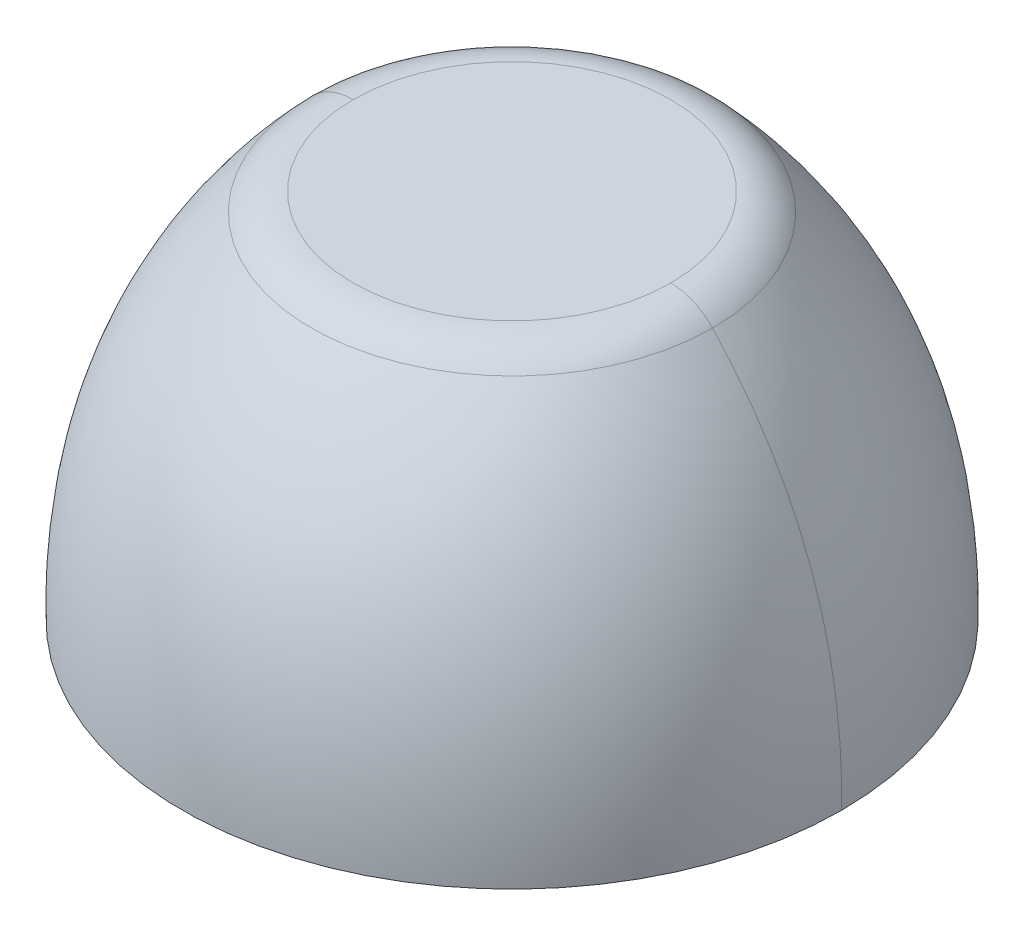
ISO-10303-21;
HEADER;
FILE_DESCRIPTION(('STEP AP214'),'2;1');
FILE_NAME('part.step','',(''),(''),'','','');
FILE_SCHEMA(('AUTOMOTIVE_DESIGN { 1 0 10303 214 1 1 1 1 }'));
ENDSEC;
DATA;
#1=APPLICATION_CONTEXT('core data for automotive mechanical design processes');
#2=APPLICATION_PROTOCOL_DEFINITION('international standard','automotive_design',2000,#1);
#3=PRODUCT_CONTEXT('',#1,'mechanical');
#4=PRODUCT('Part','Part','',(#3));
#5=PRODUCT_RELATED_PRODUCT_CATEGORY('part','',(#4));
#6=PRODUCT_DEFINITION_FORMATION('','',#4);
#7=PRODUCT_DEFINITION_CONTEXT('part definition',#1,'design');
#8=PRODUCT_DEFINITION('design','',#6,#7);
#9=PRODUCT_DEFINITION_SHAPE('','',#8);
#10=(LENGTH_UNIT() NAMED_UNIT(*) SI_UNIT(.MILLI.,.METRE.));
#11=(NAMED_UNIT(*) PLANE_ANGLE_UNIT() SI_UNIT($,.RADIAN.));
#12=(NAMED_UNIT(*) SI_UNIT($,.STERADIAN.) SOLID_ANGLE_UNIT());
#13=UNCERTAINTY_MEASURE_WITH_UNIT(LENGTH_MEASURE(1.E-05),#10,'distance_accuracy_value','');
#14=(GEOMETRIC_REPRESENTATION_CONTEXT(3) GLOBAL_UNCERTAINTY_ASSIGNED_CONTEXT((#13)) GLOBAL_UNIT_ASSIGNED_CONTEXT((#10,
#11,#12)) REPRESENTATION_CONTEXT('',''));
#15=CARTESIAN_POINT('',(0.,0.,0.));
#16=DIRECTION('',(0.,0.,1.));
#17=DIRECTION('',(1.,0.,0.));
#18=AXIS2_PLACEMENT_3D('',#15,#16,#17);
#19=CARTESIAN_POINT('',(0.,0.55,0.));
#20=DIRECTION('',(0.,-1.,0.));
#21=DIRECTION('',(1.,0.,0.));
#22=AXIS2_PLACEMENT_3D('',#19,#20,#21);
#23=TOROIDAL_SURFACE('',#22,0.277974451190381,0.1);
#24=CARTESIAN_POINT('',(-0.277974451190381,0.55,0.));
#25=DIRECTION('',(0.,0.,1.));
#26=DIRECTION('',(1.,0.,0.));
#27=AXIS2_PLACEMENT_3D('',#24,#25,#26);
#28=CIRCLE('',#27,0.1);
#29=CARTESIAN_POINT('',(-0.277974451190381,0.65,0.));
#30=VERTEX_POINT('',#29);
#31=CARTESIAN_POINT('',(-0.351124131169325,0.618184487377835,0.));
#32=VERTEX_POINT('',#31);
#33=EDGE_CURVE('E72',#30,#32,#28,.T.);
#34=ORIENTED_EDGE('',*,*,#33,.F.);
#35=CARTESIAN_POINT('',(0.,0.65,0.));
#36=DIRECTION('',(0.,1.,0.));
#37=DIRECTION('',(1.,0.,0.));
#38=AXIS2_PLACEMENT_3D('',#35,#36,#37);
#39=CIRCLE('',#38,0.277974451190381);
#40=CARTESIAN_POINT('',(0.277974451190381,0.65,0.));
#41=VERTEX_POINT('',#40);
#42=EDGE_CURVE('E11',#41,#30,#39,.T.);
#43=ORIENTED_EDGE('',*,*,#42,.F.);
#44=CARTESIAN_POINT('',(0.277974451190381,0.55,0.));
#45=DIRECTION('',(0.,0.,-1.));
#46=DIRECTION('',(-1.,0.,0.));
#47=AXIS2_PLACEMENT_3D('',#44,#45,#46);
#48=CIRCLE('',#47,0.1);
#49=CARTESIAN_POINT('',(0.351124131169325,0.618184487377835,0.));
#50=VERTEX_POINT('',#49);
#51=EDGE_CURVE('E50',#41,#50,#48,.T.);
#52=ORIENTED_EDGE('',*,*,#51,.T.);
#53=CARTESIAN_POINT('',(0.,0.618184487377835,0.));
#54=DIRECTION('',(0.,-1.,0.));
#55=DIRECTION('',(1.,0.,0.));
#56=AXIS2_PLACEMENT_3D('',#53,#54,#55);
#57=CIRCLE('',#56,0.351124131169325);
#58=EDGE_CURVE('E81',#32,#50,#57,.T.);
#59=ORIENTED_EDGE('',*,*,#58,.F.);
#60=EDGE_LOOP('',(#34,#43,#52,#59));
#61=FACE_BOUND('',#60,.T.);
#62=ADVANCED_FACE('F16',(#61),#23,.T.);
#63=CARTESIAN_POINT('',(0.,0.65,0.));
#64=DIRECTION('',(0.,-1.,0.));
#65=DIRECTION('',(0.,0.,-1.));
#66=AXIS2_PLACEMENT_3D('',#63,#64,#65);
#67=PLANE('',#66);
#68=ORIENTED_EDGE('',*,*,#42,.T.);
#69=CARTESIAN_POINT('',(0.,0.65,0.));
#70=DIRECTION('',(0.,1.,0.));
#71=DIRECTION('',(1.,0.,0.));
#72=AXIS2_PLACEMENT_3D('',#69,#70,#71);
#73=CIRCLE('',#72,0.277974451190381);
#74=EDGE_CURVE('E76',#30,#41,#73,.T.);
#75=ORIENTED_EDGE('',*,*,#74,.T.);
#76=EDGE_LOOP('',(#68,#75));
#77=FACE_BOUND('',#76,.T.);
#78=ADVANCED_FACE('F109',(#77),#67,.F.);
#79=CARTESIAN_POINT('',(0.351124131169233,0.618184487377934,0.));
#80=CARTESIAN_POINT('',(0.351124131169233,0.618184487377933,0.702248262338466));
#81=CARTESIAN_POINT('',(-0.351124131169233,0.618184487377933,0.702248262338466));
#82=CARTESIAN_POINT('',(-0.351124131169233,0.618184487377934,0.));
#83=CARTESIAN_POINT('',(0.583854239584369,0.368506978499879,0.));
#84=CARTESIAN_POINT('',(0.583854239584369,0.36850697849988,1.16770847916874));
#85=CARTESIAN_POINT('',(-0.583854239584368,0.36850697849988,1.16770847916874));
#86=CARTESIAN_POINT('',(-0.583854239584369,0.368506978499879,0.));
#87=CARTESIAN_POINT('',(0.576727971236533,0.,0.));
#88=CARTESIAN_POINT('',(0.576727971236533,0.,1.15345594247306));
#89=CARTESIAN_POINT('',(-0.576727971236532,0.,1.15345594247306));
#90=CARTESIAN_POINT('',(-0.576727971236533,0.,0.));
#91=(BOUNDED_SURFACE() B_SPLINE_SURFACE(2,3,((#79,#80,#81,#82),(#83,#84,#85,#86),(#87,#88,#89,
#90)),.UNSPECIFIED.,.F.,.F.,.F.) B_SPLINE_SURFACE_WITH_KNOTS((3,3),(4,4),(0.0607768105494967,
1.),(0.,1.),.UNSPECIFIED.) GEOMETRIC_REPRESENTATION_ITEM() RATIONAL_B_SPLINE_SURFACE(((1.,
0.333333333333334,0.333333333333334,1.),(1.,0.333333333333334,0.333333333333334,1.),(1.,
0.333333333333334,0.333333333333334,1.))) REPRESENTATION_ITEM('') SURFACE());
#92=CARTESIAN_POINT('',(0.351124131169325,0.618184487377835,0.));
#93=CARTESIAN_POINT('',(0.583854239584369,0.368506978499879,0.));
#94=CARTESIAN_POINT('',(0.576727971236533,0.,0.));
#95=(BOUNDED_CURVE() B_SPLINE_CURVE(2,(#92,#93,#94),.UNSPECIFIED.,.F.,
.F.) B_SPLINE_CURVE_WITH_KNOTS((3,3),(0.0607768105494967,1.),
.UNSPECIFIED.) CURVE() GEOMETRIC_REPRESENTATION_ITEM() RATIONAL_B_SPLINE_CURVE((1.,1.,1.)) REPRESENTATION_ITEM(''));
#96=CARTESIAN_POINT('',(0.576727971236533,0.,0.));
#97=VERTEX_POINT('',#96);
#98=EDGE_CURVE('E68',#50,#97,#95,.T.);
#99=CARTESIAN_POINT('',(0.,0.618184487377835,0.));
#100=DIRECTION('',(0.,-1.,0.));
#101=DIRECTION('',(1.,0.,0.));
#102=AXIS2_PLACEMENT_3D('',#99,#100,#101);
#103=CIRCLE('',#102,0.351124131169325);
#104=EDGE_CURVE('E61',#50,#32,#103,.T.);
#105=CARTESIAN_POINT('',(-0.351124131169325,0.618184487377835,0.));
#106=CARTESIAN_POINT('',(-0.583854239584369,0.368506978499879,0.));
#107=CARTESIAN_POINT('',(-0.576727971236533,0.,0.));
#108=(BOUNDED_CURVE() B_SPLINE_CURVE(2,(#105,#106,#107),.UNSPECIFIED.,.F.,
.F.) B_SPLINE_CURVE_WITH_KNOTS((3,3),(0.0607768105494967,1.),
.UNSPECIFIED.) CURVE() GEOMETRIC_REPRESENTATION_ITEM() RATIONAL_B_SPLINE_CURVE((1.,1.,1.)) REPRESENTATION_ITEM(''));
#109=CARTESIAN_POINT('',(-0.576727971236533,0.,0.));
#110=VERTEX_POINT('',#109);
#111=EDGE_CURVE('E65',#32,#110,#108,.T.);
#112=CARTESIAN_POINT('',(0.,0.,0.));
#113=DIRECTION('',(0.,-1.,0.));
#114=DIRECTION('',(1.,0.,0.));
#115=AXIS2_PLACEMENT_3D('',#112,#113,#114);
#116=CIRCLE('',#115,0.576727971236533);
#117=EDGE_CURVE('E19',#97,#110,#116,.T.);
#118=ORIENTED_EDGE('',*,*,#98,.F.);
#119=ORIENTED_EDGE('',*,*,#104,.T.);
#120=ORIENTED_EDGE('',*,*,#111,.T.);
#121=ORIENTED_EDGE('',*,*,#117,.F.);
#122=EDGE_LOOP('',(#118,#119,#120,#121));
#123=FACE_BOUND('',#122,.T.);
#124=ADVANCED_FACE('F63',(#123),#91,.F.);
#125=CARTESIAN_POINT('',(-0.576727971236533,0.,0.));
#126=DIRECTION('',(0.,1.,0.));
#127=DIRECTION('',(1.,0.,0.));
#128=AXIS2_PLACEMENT_3D('',#125,#126,#127);
#129=PLANE('',#128);
#130=CARTESIAN_POINT('',(0.,0.,0.));
#131=DIRECTION('',(0.,-1.,0.));
#132=DIRECTION('',(1.,0.,0.));
#133=AXIS2_PLACEMENT_3D('',#130,#131,#132);
#134=CIRCLE('',#133,0.576727971236533);
#135=EDGE_CURVE('E83',#110,#97,#134,.T.);
#136=ORIENTED_EDGE('',*,*,#135,.T.);
#137=ORIENTED_EDGE('',*,*,#117,.T.);
#138=EDGE_LOOP('',(#136,#137));
#139=FACE_BOUND('',#138,.T.);
#140=ADVANCED_FACE('F117',(#139),#129,.F.);
#141=CARTESIAN_POINT('',(0.,0.55,0.));
#142=DIRECTION('',(0.,-1.,0.));
#143=DIRECTION('',(1.,0.,0.));
#144=AXIS2_PLACEMENT_3D('',#141,#142,#143);
#145=TOROIDAL_SURFACE('',#144,0.277974451190381,0.1);
#146=ORIENTED_EDGE('',*,*,#74,.F.);
#147=ORIENTED_EDGE('',*,*,#33,.T.);
#148=ORIENTED_EDGE('',*,*,#104,.F.);
#149=ORIENTED_EDGE('',*,*,#51,.F.);
#150=EDGE_LOOP('',(#146,#147,#148,#149));
#151=FACE_BOUND('',#150,.T.);
#152=ADVANCED_FACE('F74',(#151),#145,.T.);
#153=CARTESIAN_POINT('',(-0.351124131169233,0.618184487377934,0.));
#154=CARTESIAN_POINT('',(-0.351124131169233,0.618184487377933,-0.702248262338466));
#155=CARTESIAN_POINT('',(0.351124131169233,0.618184487377933,-0.702248262338466));
#156=CARTESIAN_POINT('',(0.351124131169233,0.618184487377934,0.));
#157=CARTESIAN_POINT('',(-0.583854239584369,0.368506978499879,0.));
#158=CARTESIAN_POINT('',(-0.583854239584369,0.36850697849988,-1.16770847916874));
#159=CARTESIAN_POINT('',(0.583854239584368,0.36850697849988,-1.16770847916874));
#160=CARTESIAN_POINT('',(0.583854239584369,0.368506978499879,0.));
#161=CARTESIAN_POINT('',(-0.576727971236533,0.,0.));
#162=CARTESIAN_POINT('',(-0.576727971236533,0.,-1.15345594247306));
#163=CARTESIAN_POINT('',(0.576727971236532,0.,-1.15345594247306));
#164=CARTESIAN_POINT('',(0.576727971236533,0.,0.));
#165=(BOUNDED_SURFACE() B_SPLINE_SURFACE(2,3,((#153,#154,#155,#156),(#157,#158,#159,#160),(#161,
#162,#163,#164)),.UNSPECIFIED.,.F.,.F.,.F.) B_SPLINE_SURFACE_WITH_KNOTS((3,3),(4,4),
(0.0607768105494967,1.),(0.,1.),
.UNSPECIFIED.) GEOMETRIC_REPRESENTATION_ITEM() RATIONAL_B_SPLINE_SURFACE(((1.,0.333333333333334,
0.333333333333334,1.),(1.,0.333333333333334,0.333333333333334,1.),(1.,0.333333333333334,
0.333333333333334,1.))) REPRESENTATION_ITEM('') SURFACE());
#166=ORIENTED_EDGE('',*,*,#58,.T.);
#167=ORIENTED_EDGE('',*,*,#98,.T.);
#168=ORIENTED_EDGE('',*,*,#135,.F.);
#169=ORIENTED_EDGE('',*,*,#111,.F.);
#170=EDGE_LOOP('',(#166,#167,#168,#169));
#171=FACE_BOUND('',#170,.T.);
#172=ADVANCED_FACE('F80',(#171),#165,.F.);
#173=CLOSED_SHELL('',(#62,#78,#124,#140,#152,#172));
#174=MANIFOLD_SOLID_BREP('B1',#173);
#175=ADVANCED_BREP_SHAPE_REPRESENTATION('',(#18,#174),#14);
#176=SHAPE_DEFINITION_REPRESENTATION(#9,#175);
ENDSEC;
END-ISO-10303-21;
